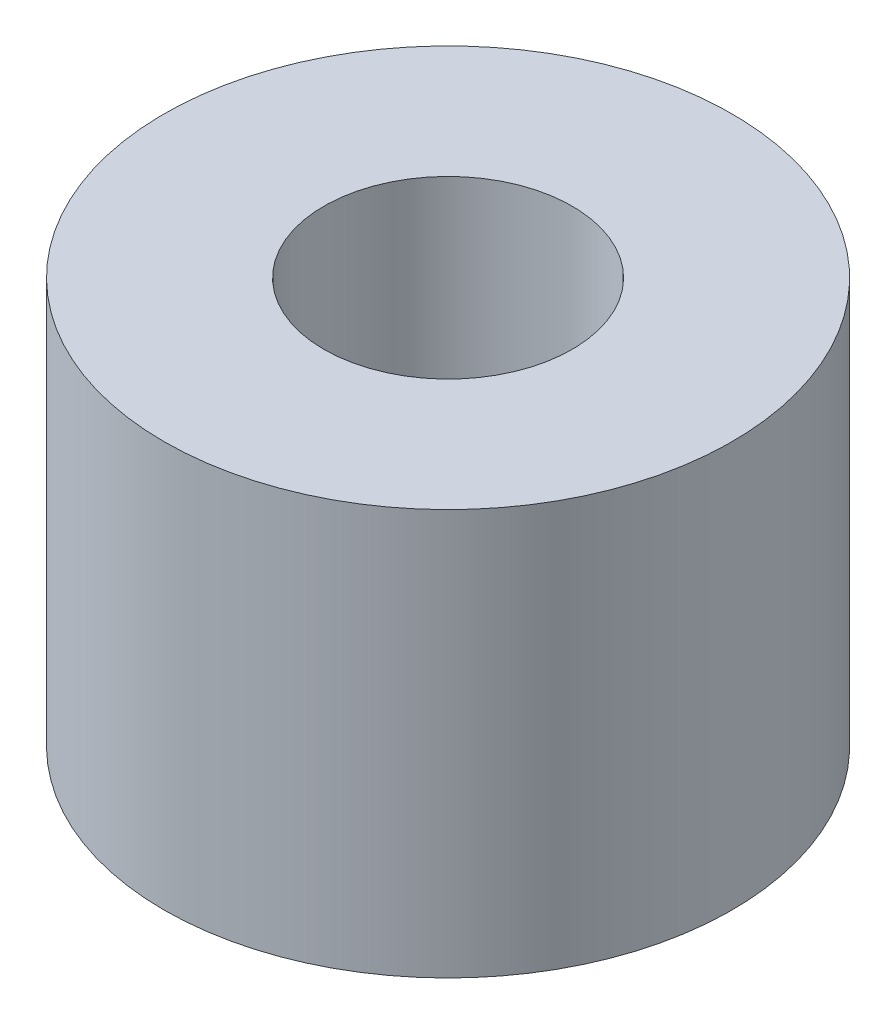
ISO-10303-21;
HEADER;
FILE_DESCRIPTION(('STEP AP214'),'2;1');
FILE_NAME('part.step','',(''),(''),'','','');
FILE_SCHEMA(('AUTOMOTIVE_DESIGN { 1 0 10303 214 1 1 1 1 }'));
ENDSEC;
DATA;
#1=APPLICATION_CONTEXT('core data for automotive mechanical design processes');
#2=APPLICATION_PROTOCOL_DEFINITION('international standard','automotive_design',2000,#1);
#3=PRODUCT_CONTEXT('',#1,'mechanical');
#4=PRODUCT('Part','Part','',(#3));
#5=PRODUCT_RELATED_PRODUCT_CATEGORY('part','',(#4));
#6=PRODUCT_DEFINITION_FORMATION('','',#4);
#7=PRODUCT_DEFINITION_CONTEXT('part definition',#1,'design');
#8=PRODUCT_DEFINITION('design','',#6,#7);
#9=PRODUCT_DEFINITION_SHAPE('','',#8);
#10=(LENGTH_UNIT() NAMED_UNIT(*) SI_UNIT(.MILLI.,.METRE.));
#11=(NAMED_UNIT(*) PLANE_ANGLE_UNIT() SI_UNIT($,.RADIAN.));
#12=(NAMED_UNIT(*) SI_UNIT($,.STERADIAN.) SOLID_ANGLE_UNIT());
#13=UNCERTAINTY_MEASURE_WITH_UNIT(LENGTH_MEASURE(1.E-05),#10,'distance_accuracy_value','');
#14=(GEOMETRIC_REPRESENTATION_CONTEXT(3) GLOBAL_UNCERTAINTY_ASSIGNED_CONTEXT((#13)) GLOBAL_UNIT_ASSIGNED_CONTEXT((#10,
#11,#12)) REPRESENTATION_CONTEXT('',''));
#15=CARTESIAN_POINT('',(0.,0.,0.));
#16=DIRECTION('',(0.,0.,1.));
#17=DIRECTION('',(1.,0.,0.));
#18=AXIS2_PLACEMENT_3D('',#15,#16,#17);
#19=CARTESIAN_POINT('',(0.,5.,0.));
#20=DIRECTION('',(0.,1.,0.));
#21=DIRECTION('',(0.,0.,1.));
#22=AXIS2_PLACEMENT_3D('',#19,#20,#21);
#23=PLANE('',#22);
#24=CARTESIAN_POINT('',(0.,5.,0.));
#25=DIRECTION('',(0.,1.,0.));
#26=DIRECTION('',(0.,0.,1.));
#27=AXIS2_PLACEMENT_3D('',#24,#25,#26);
#28=CIRCLE('',#27,3.5);
#29=CARTESIAN_POINT('',(0.,5.,3.5));
#30=VERTEX_POINT('',#29);
#31=EDGE_CURVE('E10',#30,#30,#28,.T.);
#32=ORIENTED_EDGE('',*,*,#31,.T.);
#33=EDGE_LOOP('',(#32));
#34=FACE_BOUND('',#33,.T.);
#35=CARTESIAN_POINT('',(0.,5.,0.));
#36=DIRECTION('',(0.,1.,0.));
#37=DIRECTION('',(0.,0.,1.));
#38=AXIS2_PLACEMENT_3D('',#35,#36,#37);
#39=CIRCLE('',#38,1.53);
#40=CARTESIAN_POINT('',(0.,5.,1.53));
#41=VERTEX_POINT('',#40);
#42=EDGE_CURVE('E42',#41,#41,#39,.T.);
#43=ORIENTED_EDGE('',*,*,#42,.F.);
#44=EDGE_LOOP('',(#43));
#45=FACE_BOUND('',#44,.T.);
#46=ADVANCED_FACE('F31',(#34,#45),#23,.T.);
#47=CARTESIAN_POINT('',(0.,0.,0.));
#48=DIRECTION('',(0.,1.,0.));
#49=DIRECTION('',(0.,0.,1.));
#50=AXIS2_PLACEMENT_3D('',#47,#48,#49);
#51=PLANE('',#50);
#52=CARTESIAN_POINT('',(0.,0.,0.));
#53=DIRECTION('',(0.,1.,0.));
#54=DIRECTION('',(0.,0.,1.));
#55=AXIS2_PLACEMENT_3D('',#52,#53,#54);
#56=CIRCLE('',#55,3.5);
#57=CARTESIAN_POINT('',(0.,0.,3.5));
#58=VERTEX_POINT('',#57);
#59=EDGE_CURVE('E35',#58,#58,#56,.T.);
#60=ORIENTED_EDGE('',*,*,#59,.F.);
#61=EDGE_LOOP('',(#60));
#62=FACE_BOUND('',#61,.T.);
#63=CARTESIAN_POINT('',(0.,0.,0.));
#64=DIRECTION('',(0.,1.,0.));
#65=DIRECTION('',(0.,0.,1.));
#66=AXIS2_PLACEMENT_3D('',#63,#64,#65);
#67=CIRCLE('',#66,1.53);
#68=CARTESIAN_POINT('',(0.,0.,1.53));
#69=VERTEX_POINT('',#68);
#70=EDGE_CURVE('E44',#69,#69,#67,.T.);
#71=ORIENTED_EDGE('',*,*,#70,.T.);
#72=EDGE_LOOP('',(#71));
#73=FACE_BOUND('',#72,.T.);
#74=ADVANCED_FACE('F54',(#62,#73),#51,.F.);
#75=CARTESIAN_POINT('',(0.,5.,0.));
#76=DIRECTION('',(0.,-1.,0.));
#77=DIRECTION('',(0.,0.,-1.));
#78=AXIS2_PLACEMENT_3D('',#75,#76,#77);
#79=CYLINDRICAL_SURFACE('',#78,3.5);
#80=ORIENTED_EDGE('',*,*,#31,.F.);
#81=EDGE_LOOP('',(#80));
#82=FACE_BOUND('',#81,.T.);
#83=ORIENTED_EDGE('',*,*,#59,.T.);
#84=EDGE_LOOP('',(#83));
#85=FACE_BOUND('',#84,.T.);
#86=ADVANCED_FACE('F33',(#82,#85),#79,.T.);
#87=CARTESIAN_POINT('',(0.,5.,0.));
#88=DIRECTION('',(0.,-1.,0.));
#89=DIRECTION('',(0.,0.,-1.));
#90=AXIS2_PLACEMENT_3D('',#87,#88,#89);
#91=CYLINDRICAL_SURFACE('',#90,1.53);
#92=ORIENTED_EDGE('',*,*,#42,.T.);
#93=EDGE_LOOP('',(#92));
#94=FACE_BOUND('',#93,.T.);
#95=ORIENTED_EDGE('',*,*,#70,.F.);
#96=EDGE_LOOP('',(#95));
#97=FACE_BOUND('',#96,.T.);
#98=ADVANCED_FACE('F50',(#94,#97),#91,.F.);
#99=CLOSED_SHELL('',(#46,#74,#86,#98));
#100=MANIFOLD_SOLID_BREP('B2',#99);
#101=ADVANCED_BREP_SHAPE_REPRESENTATION('',(#18,#100),#14);
#102=SHAPE_DEFINITION_REPRESENTATION(#9,#101);
ENDSEC;
END-ISO-10303-21;
